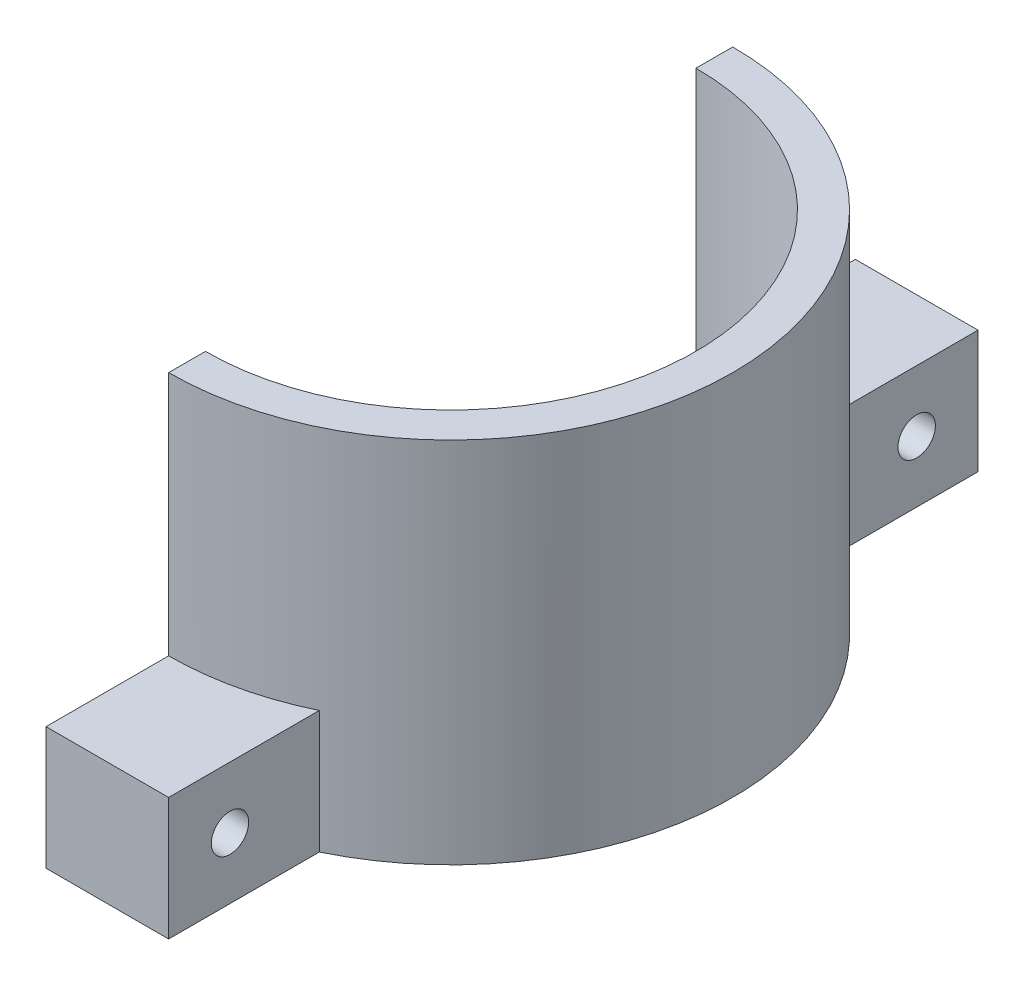
ISO-10303-21;
HEADER;
FILE_DESCRIPTION(('STEP AP214'),'2;1');
FILE_NAME('part.step','',(''),(''),'','','');
FILE_SCHEMA(('AUTOMOTIVE_DESIGN { 1 0 10303 214 1 1 1 1 }'));
ENDSEC;
DATA;
#1=APPLICATION_CONTEXT('core data for automotive mechanical design processes');
#2=APPLICATION_PROTOCOL_DEFINITION('international standard','automotive_design',2000,#1);
#3=PRODUCT_CONTEXT('',#1,'mechanical');
#4=PRODUCT('Part','Part','',(#3));
#5=PRODUCT_RELATED_PRODUCT_CATEGORY('part','',(#4));
#6=PRODUCT_DEFINITION_FORMATION('','',#4);
#7=PRODUCT_DEFINITION_CONTEXT('part definition',#1,'design');
#8=PRODUCT_DEFINITION('design','',#6,#7);
#9=PRODUCT_DEFINITION_SHAPE('','',#8);
#10=(LENGTH_UNIT() NAMED_UNIT(*) SI_UNIT(.MILLI.,.METRE.));
#11=(NAMED_UNIT(*) PLANE_ANGLE_UNIT() SI_UNIT($,.RADIAN.));
#12=(NAMED_UNIT(*) SI_UNIT($,.STERADIAN.) SOLID_ANGLE_UNIT());
#13=UNCERTAINTY_MEASURE_WITH_UNIT(LENGTH_MEASURE(1.E-05),#10,'distance_accuracy_value','');
#14=(GEOMETRIC_REPRESENTATION_CONTEXT(3) GLOBAL_UNCERTAINTY_ASSIGNED_CONTEXT((#13)) GLOBAL_UNIT_ASSIGNED_CONTEXT((#10,
#11,#12)) REPRESENTATION_CONTEXT('',''));
#15=CARTESIAN_POINT('',(0.,0.,0.));
#16=DIRECTION('',(0.,0.,1.));
#17=DIRECTION('',(1.,0.,0.));
#18=AXIS2_PLACEMENT_3D('',#15,#16,#17);
#19=CARTESIAN_POINT('',(0.,30.,0.));
#20=DIRECTION('',(0.,-1.,0.));
#21=DIRECTION('',(0.,0.,-1.));
#22=AXIS2_PLACEMENT_3D('',#19,#20,#21);
#23=CYLINDRICAL_SURFACE('',#22,20.);
#24=CARTESIAN_POINT('',(0.,0.,0.));
#25=DIRECTION('',(0.,-1.,0.));
#26=DIRECTION('',(0.,0.,-1.));
#27=AXIS2_PLACEMENT_3D('',#24,#25,#26);
#28=CIRCLE('',#27,20.);
#29=CARTESIAN_POINT('',(0.,0.,-20.));
#30=VERTEX_POINT('',#29);
#31=CARTESIAN_POINT('',(0.,0.,20.));
#32=VERTEX_POINT('',#31);
#33=EDGE_CURVE('E163',#30,#32,#28,.T.);
#34=ORIENTED_EDGE('',*,*,#33,.T.);
#35=DIRECTION('',(0.,-1.,0.));
#36=VECTOR('',#35,1.);
#37=CARTESIAN_POINT('',(0.,30.,20.));
#38=LINE('',#37,#36);
#39=CARTESIAN_POINT('',(0.,30.,20.));
#40=VERTEX_POINT('',#39);
#41=EDGE_CURVE('E11',#40,#32,#38,.T.);
#42=ORIENTED_EDGE('',*,*,#41,.F.);
#43=CARTESIAN_POINT('',(0.,30.,0.));
#44=DIRECTION('',(0.,-1.,0.));
#45=DIRECTION('',(0.,0.,-1.));
#46=AXIS2_PLACEMENT_3D('',#43,#44,#45);
#47=CIRCLE('',#46,20.);
#48=CARTESIAN_POINT('',(0.,30.,-20.));
#49=VERTEX_POINT('',#48);
#50=EDGE_CURVE('E168',#49,#40,#47,.T.);
#51=ORIENTED_EDGE('',*,*,#50,.F.);
#52=DIRECTION('',(0.,-1.,0.));
#53=VECTOR('',#52,1.);
#54=CARTESIAN_POINT('',(0.,30.,-20.));
#55=LINE('',#54,#53);
#56=EDGE_CURVE('E178',#49,#30,#55,.T.);
#57=ORIENTED_EDGE('',*,*,#56,.T.);
#58=EDGE_LOOP('',(#34,#42,#51,#57));
#59=FACE_BOUND('',#58,.T.);
#60=ADVANCED_FACE('F33',(#59),#23,.F.);
#61=CARTESIAN_POINT('',(0.,30.,20.));
#62=DIRECTION('',(1.,0.,0.));
#63=DIRECTION('',(0.,0.,-1.));
#64=AXIS2_PLACEMENT_3D('',#61,#62,#63);
#65=PLANE('',#64);
#66=CARTESIAN_POINT('',(0.,5.,28.));
#67=DIRECTION('',(-1.,0.,0.));
#68=DIRECTION('',(0.,0.,1.));
#69=AXIS2_PLACEMENT_3D('',#66,#67,#68);
#70=CIRCLE('',#69,1.524);
#71=CARTESIAN_POINT('',(0.,5.,29.524));
#72=VERTEX_POINT('',#71);
#73=EDGE_CURVE('E239',#72,#72,#70,.T.);
#74=ORIENTED_EDGE('',*,*,#73,.F.);
#75=EDGE_LOOP('',(#74));
#76=FACE_BOUND('',#75,.T.);
#77=DIRECTION('',(0.,0.,1.));
#78=VECTOR('',#77,1.);
#79=CARTESIAN_POINT('',(0.,0.,20.));
#80=LINE('',#79,#78);
#81=CARTESIAN_POINT('',(0.,0.,33.));
#82=VERTEX_POINT('',#81);
#83=EDGE_CURVE('E181',#32,#82,#80,.T.);
#84=ORIENTED_EDGE('',*,*,#83,.T.);
#85=DIRECTION('',(0.,-1.,0.));
#86=VECTOR('',#85,1.);
#87=CARTESIAN_POINT('',(0.,10.,33.));
#88=LINE('',#87,#86);
#89=CARTESIAN_POINT('',(0.,10.,33.));
#90=VERTEX_POINT('',#89);
#91=EDGE_CURVE('E160',#90,#82,#88,.T.);
#92=ORIENTED_EDGE('',*,*,#91,.F.);
#93=DIRECTION('',(0.,0.,-1.));
#94=VECTOR('',#93,1.);
#95=CARTESIAN_POINT('',(0.,10.,23.));
#96=LINE('',#95,#94);
#97=CARTESIAN_POINT('',(0.,10.,23.));
#98=VERTEX_POINT('',#97);
#99=EDGE_CURVE('E152',#90,#98,#96,.T.);
#100=ORIENTED_EDGE('',*,*,#99,.T.);
#101=DIRECTION('',(0.,-1.,0.));
#102=VECTOR('',#101,1.);
#103=CARTESIAN_POINT('',(0.,30.,23.));
#104=LINE('',#103,#102);
#105=CARTESIAN_POINT('',(0.,30.,23.));
#106=VERTEX_POINT('',#105);
#107=EDGE_CURVE('E40',#106,#98,#104,.T.);
#108=ORIENTED_EDGE('',*,*,#107,.F.);
#109=DIRECTION('',(0.,0.,1.));
#110=VECTOR('',#109,1.);
#111=CARTESIAN_POINT('',(0.,30.,20.));
#112=LINE('',#111,#110);
#113=EDGE_CURVE('E171',#40,#106,#112,.T.);
#114=ORIENTED_EDGE('',*,*,#113,.F.);
#115=ORIENTED_EDGE('',*,*,#41,.T.);
#116=EDGE_LOOP('',(#84,#92,#100,#108,#114,#115));
#117=FACE_BOUND('',#116,.T.);
#118=ADVANCED_FACE('F199',(#76,#117),#65,.F.);
#119=CARTESIAN_POINT('',(0.,30.,0.));
#120=DIRECTION('',(0.,-1.,0.));
#121=DIRECTION('',(0.,0.,-1.));
#122=AXIS2_PLACEMENT_3D('',#119,#120,#121);
#123=CYLINDRICAL_SURFACE('',#122,23.);
#124=CARTESIAN_POINT('',(0.,0.,0.));
#125=DIRECTION('',(0.,1.,0.));
#126=DIRECTION('',(0.,0.,-1.));
#127=AXIS2_PLACEMENT_3D('',#124,#125,#126);
#128=CIRCLE('',#127,23.);
#129=CARTESIAN_POINT('',(10.,0.,20.712315177208));
#130=VERTEX_POINT('',#129);
#131=CARTESIAN_POINT('',(10.,0.,-20.712315177208));
#132=VERTEX_POINT('',#131);
#133=EDGE_CURVE('E183',#130,#132,#128,.T.);
#134=ORIENTED_EDGE('',*,*,#133,.T.);
#135=DIRECTION('',(0.,-1.,0.));
#136=VECTOR('',#135,1.);
#137=CARTESIAN_POINT('',(10.,10.,-20.712315177208));
#138=LINE('',#137,#136);
#139=CARTESIAN_POINT('',(10.,10.,-20.712315177208));
#140=VERTEX_POINT('',#139);
#141=EDGE_CURVE('E47',#140,#132,#138,.T.);
#142=ORIENTED_EDGE('',*,*,#141,.F.);
#143=CARTESIAN_POINT('',(0.,10.,0.));
#144=DIRECTION('',(0.,1.,0.));
#145=DIRECTION('',(0.,0.,-1.));
#146=AXIS2_PLACEMENT_3D('',#143,#144,#145);
#147=CIRCLE('',#146,23.);
#148=CARTESIAN_POINT('',(0.,10.,-23.));
#149=VERTEX_POINT('',#148);
#150=EDGE_CURVE('E51',#140,#149,#147,.T.);
#151=ORIENTED_EDGE('',*,*,#150,.T.);
#152=DIRECTION('',(0.,-1.,0.));
#153=VECTOR('',#152,1.);
#154=CARTESIAN_POINT('',(0.,30.,-23.));
#155=LINE('',#154,#153);
#156=CARTESIAN_POINT('',(0.,30.,-23.));
#157=VERTEX_POINT('',#156);
#158=EDGE_CURVE('E129',#157,#149,#155,.T.);
#159=ORIENTED_EDGE('',*,*,#158,.F.);
#160=CARTESIAN_POINT('',(0.,30.,0.));
#161=DIRECTION('',(0.,1.,0.));
#162=DIRECTION('',(0.,0.,-1.));
#163=AXIS2_PLACEMENT_3D('',#160,#161,#162);
#164=CIRCLE('',#163,23.);
#165=EDGE_CURVE('E174',#106,#157,#164,.T.);
#166=ORIENTED_EDGE('',*,*,#165,.F.);
#167=ORIENTED_EDGE('',*,*,#107,.T.);
#168=CARTESIAN_POINT('',(0.,10.,0.));
#169=DIRECTION('',(0.,1.,0.));
#170=DIRECTION('',(0.,0.,1.));
#171=AXIS2_PLACEMENT_3D('',#168,#169,#170);
#172=CIRCLE('',#171,23.);
#173=CARTESIAN_POINT('',(10.,10.,20.712315177208));
#174=VERTEX_POINT('',#173);
#175=EDGE_CURVE('E143',#98,#174,#172,.T.);
#176=ORIENTED_EDGE('',*,*,#175,.T.);
#177=DIRECTION('',(0.,-1.,0.));
#178=VECTOR('',#177,1.);
#179=CARTESIAN_POINT('',(10.,10.,20.712315177208));
#180=LINE('',#179,#178);
#181=EDGE_CURVE('E155',#174,#130,#180,.T.);
#182=ORIENTED_EDGE('',*,*,#181,.T.);
#183=EDGE_LOOP('',(#134,#142,#151,#159,#166,#167,#176,#182));
#184=FACE_BOUND('',#183,.T.);
#185=ADVANCED_FACE('F191',(#184),#123,.T.);
#186=CARTESIAN_POINT('',(0.,30.,-23.));
#187=DIRECTION('',(1.,0.,0.));
#188=DIRECTION('',(0.,0.,-1.));
#189=AXIS2_PLACEMENT_3D('',#186,#187,#188);
#190=PLANE('',#189);
#191=CARTESIAN_POINT('',(0.,5.,-28.));
#192=DIRECTION('',(-1.,0.,0.));
#193=DIRECTION('',(0.,0.,1.));
#194=AXIS2_PLACEMENT_3D('',#191,#192,#193);
#195=CIRCLE('',#194,1.524);
#196=CARTESIAN_POINT('',(0.,5.,-26.476));
#197=VERTEX_POINT('',#196);
#198=EDGE_CURVE('E137',#197,#197,#195,.T.);
#199=ORIENTED_EDGE('',*,*,#198,.F.);
#200=EDGE_LOOP('',(#199));
#201=FACE_BOUND('',#200,.T.);
#202=DIRECTION('',(0.,0.,1.));
#203=VECTOR('',#202,1.);
#204=CARTESIAN_POINT('',(0.,0.,-23.));
#205=LINE('',#204,#203);
#206=CARTESIAN_POINT('',(0.,0.,-33.));
#207=VERTEX_POINT('',#206);
#208=EDGE_CURVE('E172',#207,#30,#205,.T.);
#209=ORIENTED_EDGE('',*,*,#208,.T.);
#210=ORIENTED_EDGE('',*,*,#56,.F.);
#211=DIRECTION('',(0.,0.,1.));
#212=VECTOR('',#211,1.);
#213=CARTESIAN_POINT('',(0.,30.,-23.));
#214=LINE('',#213,#212);
#215=EDGE_CURVE('E176',#157,#49,#214,.T.);
#216=ORIENTED_EDGE('',*,*,#215,.F.);
#217=ORIENTED_EDGE('',*,*,#158,.T.);
#218=DIRECTION('',(0.,0.,-1.));
#219=VECTOR('',#218,1.);
#220=CARTESIAN_POINT('',(0.,10.,-23.));
#221=LINE('',#220,#219);
#222=CARTESIAN_POINT('',(0.,10.,-33.));
#223=VERTEX_POINT('',#222);
#224=EDGE_CURVE('E124',#149,#223,#221,.T.);
#225=ORIENTED_EDGE('',*,*,#224,.T.);
#226=DIRECTION('',(0.,-1.,0.));
#227=VECTOR('',#226,1.);
#228=CARTESIAN_POINT('',(0.,10.,-33.));
#229=LINE('',#228,#227);
#230=EDGE_CURVE('E109',#223,#207,#229,.T.);
#231=ORIENTED_EDGE('',*,*,#230,.T.);
#232=EDGE_LOOP('',(#209,#210,#216,#217,#225,#231));
#233=FACE_BOUND('',#232,.T.);
#234=ADVANCED_FACE('F127',(#201,#233),#190,.F.);
#235=CARTESIAN_POINT('',(0.,30.,0.));
#236=DIRECTION('',(0.,-1.,0.));
#237=DIRECTION('',(0.,0.,-1.));
#238=AXIS2_PLACEMENT_3D('',#235,#236,#237);
#239=PLANE('',#238);
#240=ORIENTED_EDGE('',*,*,#50,.T.);
#241=ORIENTED_EDGE('',*,*,#113,.T.);
#242=ORIENTED_EDGE('',*,*,#165,.T.);
#243=ORIENTED_EDGE('',*,*,#215,.T.);
#244=EDGE_LOOP('',(#240,#241,#242,#243));
#245=FACE_BOUND('',#244,.T.);
#246=ADVANCED_FACE('F217',(#245),#239,.F.);
#247=CARTESIAN_POINT('',(0.,0.,0.));
#248=DIRECTION('',(0.,-1.,0.));
#249=DIRECTION('',(0.,0.,-1.));
#250=AXIS2_PLACEMENT_3D('',#247,#248,#249);
#251=PLANE('',#250);
#252=ORIENTED_EDGE('',*,*,#33,.F.);
#253=ORIENTED_EDGE('',*,*,#208,.F.);
#254=DIRECTION('',(1.,0.,0.));
#255=VECTOR('',#254,1.);
#256=CARTESIAN_POINT('',(0.,0.,-33.));
#257=LINE('',#256,#255);
#258=CARTESIAN_POINT('',(10.,0.,-33.));
#259=VERTEX_POINT('',#258);
#260=EDGE_CURVE('E115',#207,#259,#257,.T.);
#261=ORIENTED_EDGE('',*,*,#260,.T.);
#262=DIRECTION('',(0.,0.,1.));
#263=VECTOR('',#262,1.);
#264=CARTESIAN_POINT('',(10.,0.,-20.712315177208));
#265=LINE('',#264,#263);
#266=EDGE_CURVE('E131',#259,#132,#265,.T.);
#267=ORIENTED_EDGE('',*,*,#266,.T.);
#268=ORIENTED_EDGE('',*,*,#133,.F.);
#269=DIRECTION('',(0.,0.,1.));
#270=VECTOR('',#269,1.);
#271=CARTESIAN_POINT('',(10.,0.,20.712315177208));
#272=LINE('',#271,#270);
#273=CARTESIAN_POINT('',(10.,0.,33.));
#274=VERTEX_POINT('',#273);
#275=EDGE_CURVE('E141',#130,#274,#272,.T.);
#276=ORIENTED_EDGE('',*,*,#275,.T.);
#277=DIRECTION('',(-1.,0.,0.));
#278=VECTOR('',#277,1.);
#279=CARTESIAN_POINT('',(0.,0.,33.));
#280=LINE('',#279,#278);
#281=EDGE_CURVE('E146',#274,#82,#280,.T.);
#282=ORIENTED_EDGE('',*,*,#281,.T.);
#283=ORIENTED_EDGE('',*,*,#83,.F.);
#284=EDGE_LOOP('',(#252,#253,#261,#267,#268,#276,#282,#283));
#285=FACE_BOUND('',#284,.T.);
#286=ADVANCED_FACE('F211',(#285),#251,.T.);
#287=CARTESIAN_POINT('',(0.,10.,33.));
#288=DIRECTION('',(0.,0.,1.));
#289=DIRECTION('',(1.,0.,0.));
#290=AXIS2_PLACEMENT_3D('',#287,#288,#289);
#291=PLANE('',#290);
#292=ORIENTED_EDGE('',*,*,#281,.F.);
#293=DIRECTION('',(0.,-1.,0.));
#294=VECTOR('',#293,1.);
#295=CARTESIAN_POINT('',(10.,10.,33.));
#296=LINE('',#295,#294);
#297=CARTESIAN_POINT('',(10.,10.,33.));
#298=VERTEX_POINT('',#297);
#299=EDGE_CURVE('E164',#298,#274,#296,.T.);
#300=ORIENTED_EDGE('',*,*,#299,.F.);
#301=DIRECTION('',(-1.,0.,0.));
#302=VECTOR('',#301,1.);
#303=CARTESIAN_POINT('',(0.,10.,33.));
#304=LINE('',#303,#302);
#305=EDGE_CURVE('E149',#298,#90,#304,.T.);
#306=ORIENTED_EDGE('',*,*,#305,.T.);
#307=ORIENTED_EDGE('',*,*,#91,.T.);
#308=EDGE_LOOP('',(#292,#300,#306,#307));
#309=FACE_BOUND('',#308,.T.);
#310=ADVANCED_FACE('F202',(#309),#291,.T.);
#311=CARTESIAN_POINT('',(10.,10.,20.712315177208));
#312=DIRECTION('',(1.,0.,0.));
#313=DIRECTION('',(0.,0.,-1.));
#314=AXIS2_PLACEMENT_3D('',#311,#312,#313);
#315=PLANE('',#314);
#316=CARTESIAN_POINT('',(10.,5.,28.));
#317=DIRECTION('',(1.,0.,0.));
#318=DIRECTION('',(0.,0.,-1.));
#319=AXIS2_PLACEMENT_3D('',#316,#317,#318);
#320=CIRCLE('',#319,1.524);
#321=CARTESIAN_POINT('',(10.,5.,26.476));
#322=VERTEX_POINT('',#321);
#323=EDGE_CURVE('E242',#322,#322,#320,.F.);
#324=ORIENTED_EDGE('',*,*,#323,.T.);
#325=EDGE_LOOP('',(#324));
#326=FACE_BOUND('',#325,.T.);
#327=ORIENTED_EDGE('',*,*,#275,.F.);
#328=ORIENTED_EDGE('',*,*,#181,.F.);
#329=DIRECTION('',(0.,0.,1.));
#330=VECTOR('',#329,1.);
#331=CARTESIAN_POINT('',(10.,10.,20.712315177208));
#332=LINE('',#331,#330);
#333=EDGE_CURVE('E145',#174,#298,#332,.T.);
#334=ORIENTED_EDGE('',*,*,#333,.T.);
#335=ORIENTED_EDGE('',*,*,#299,.T.);
#336=EDGE_LOOP('',(#327,#328,#334,#335));
#337=FACE_BOUND('',#336,.T.);
#338=ADVANCED_FACE('F205',(#326,#337),#315,.T.);
#339=CARTESIAN_POINT('',(0.,10.,0.));
#340=DIRECTION('',(0.,1.,0.));
#341=DIRECTION('',(0.,0.,1.));
#342=AXIS2_PLACEMENT_3D('',#339,#340,#341);
#343=PLANE('',#342);
#344=ORIENTED_EDGE('',*,*,#175,.F.);
#345=ORIENTED_EDGE('',*,*,#99,.F.);
#346=ORIENTED_EDGE('',*,*,#305,.F.);
#347=ORIENTED_EDGE('',*,*,#333,.F.);
#348=EDGE_LOOP('',(#344,#345,#346,#347));
#349=FACE_BOUND('',#348,.T.);
#350=ADVANCED_FACE('F197',(#349),#343,.T.);
#351=CARTESIAN_POINT('',(10.,10.,-20.712315177208));
#352=DIRECTION('',(1.,0.,0.));
#353=DIRECTION('',(0.,0.,-1.));
#354=AXIS2_PLACEMENT_3D('',#351,#352,#353);
#355=PLANE('',#354);
#356=CARTESIAN_POINT('',(10.,5.,-28.));
#357=DIRECTION('',(1.,0.,0.));
#358=DIRECTION('',(0.,0.,-1.));
#359=AXIS2_PLACEMENT_3D('',#356,#357,#358);
#360=CIRCLE('',#359,1.524);
#361=CARTESIAN_POINT('',(10.,5.,-29.524));
#362=VERTEX_POINT('',#361);
#363=EDGE_CURVE('E241',#362,#362,#360,.F.);
#364=ORIENTED_EDGE('',*,*,#363,.T.);
#365=EDGE_LOOP('',(#364));
#366=FACE_BOUND('',#365,.T.);
#367=ORIENTED_EDGE('',*,*,#266,.F.);
#368=DIRECTION('',(0.,-1.,0.));
#369=VECTOR('',#368,1.);
#370=CARTESIAN_POINT('',(10.,10.,-33.));
#371=LINE('',#370,#369);
#372=CARTESIAN_POINT('',(10.,10.,-33.));
#373=VERTEX_POINT('',#372);
#374=EDGE_CURVE('E118',#373,#259,#371,.T.);
#375=ORIENTED_EDGE('',*,*,#374,.F.);
#376=DIRECTION('',(0.,0.,1.));
#377=VECTOR('',#376,1.);
#378=CARTESIAN_POINT('',(10.,10.,-20.712315177208));
#379=LINE('',#378,#377);
#380=EDGE_CURVE('E119',#373,#140,#379,.T.);
#381=ORIENTED_EDGE('',*,*,#380,.T.);
#382=ORIENTED_EDGE('',*,*,#141,.T.);
#383=EDGE_LOOP('',(#367,#375,#381,#382));
#384=FACE_BOUND('',#383,.T.);
#385=ADVANCED_FACE('F209',(#366,#384),#355,.T.);
#386=CARTESIAN_POINT('',(0.,10.,-33.));
#387=DIRECTION('',(0.,0.,-1.));
#388=DIRECTION('',(-1.,0.,0.));
#389=AXIS2_PLACEMENT_3D('',#386,#387,#388);
#390=PLANE('',#389);
#391=ORIENTED_EDGE('',*,*,#260,.F.);
#392=ORIENTED_EDGE('',*,*,#230,.F.);
#393=DIRECTION('',(1.,0.,0.));
#394=VECTOR('',#393,1.);
#395=CARTESIAN_POINT('',(0.,10.,-33.));
#396=LINE('',#395,#394);
#397=EDGE_CURVE('E112',#223,#373,#396,.T.);
#398=ORIENTED_EDGE('',*,*,#397,.T.);
#399=ORIENTED_EDGE('',*,*,#374,.T.);
#400=EDGE_LOOP('',(#391,#392,#398,#399));
#401=FACE_BOUND('',#400,.T.);
#402=ADVANCED_FACE('F111',(#401),#390,.T.);
#403=CARTESIAN_POINT('',(0.,10.,0.));
#404=DIRECTION('',(0.,-1.,0.));
#405=DIRECTION('',(0.,0.,-1.));
#406=AXIS2_PLACEMENT_3D('',#403,#404,#405);
#407=PLANE('',#406);
#408=ORIENTED_EDGE('',*,*,#150,.F.);
#409=ORIENTED_EDGE('',*,*,#380,.F.);
#410=ORIENTED_EDGE('',*,*,#397,.F.);
#411=ORIENTED_EDGE('',*,*,#224,.F.);
#412=EDGE_LOOP('',(#408,#409,#410,#411));
#413=FACE_BOUND('',#412,.T.);
#414=ADVANCED_FACE('F123',(#413),#407,.F.);
#415=CARTESIAN_POINT('',(23.001,5.,-28.));
#416=DIRECTION('',(-1.,0.,0.));
#417=DIRECTION('',(0.,0.,1.));
#418=AXIS2_PLACEMENT_3D('',#415,#416,#417);
#419=CYLINDRICAL_SURFACE('',#418,1.524);
#420=ORIENTED_EDGE('',*,*,#363,.F.);
#421=EDGE_LOOP('',(#420));
#422=FACE_BOUND('',#421,.T.);
#423=ORIENTED_EDGE('',*,*,#198,.T.);
#424=EDGE_LOOP('',(#423));
#425=FACE_BOUND('',#424,.T.);
#426=ADVANCED_FACE('F251',(#422,#425),#419,.F.);
#427=CARTESIAN_POINT('',(23.001,5.,28.));
#428=DIRECTION('',(-1.,0.,0.));
#429=DIRECTION('',(0.,0.,1.));
#430=AXIS2_PLACEMENT_3D('',#427,#428,#429);
#431=CYLINDRICAL_SURFACE('',#430,1.524);
#432=ORIENTED_EDGE('',*,*,#323,.F.);
#433=EDGE_LOOP('',(#432));
#434=FACE_BOUND('',#433,.T.);
#435=ORIENTED_EDGE('',*,*,#73,.T.);
#436=EDGE_LOOP('',(#435));
#437=FACE_BOUND('',#436,.T.);
#438=ADVANCED_FACE('F253',(#434,#437),#431,.F.);
#439=CLOSED_SHELL('',(#60,#118,#185,#234,#246,#286,#310,#338,#350,#385,#402,#414,#426,#438));
#440=MANIFOLD_SOLID_BREP('B2',#439);
#441=ADVANCED_BREP_SHAPE_REPRESENTATION('',(#18,#440),#14);
#442=SHAPE_DEFINITION_REPRESENTATION(#9,#441);
ENDSEC;
END-ISO-10303-21;
